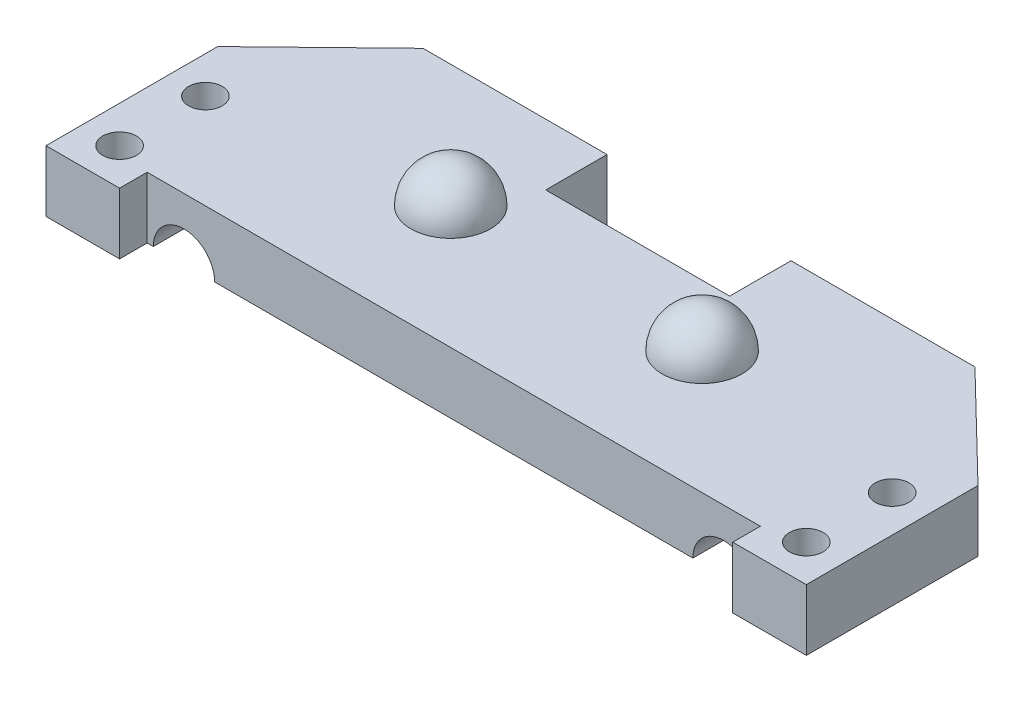
ISO-10303-21;
HEADER;
FILE_DESCRIPTION(('STEP AP214'),'2;1');
FILE_NAME('part.step','',(''),(''),'','','');
FILE_SCHEMA(('AUTOMOTIVE_DESIGN { 1 0 10303 214 1 1 1 1 }'));
ENDSEC;
DATA;
#1=APPLICATION_CONTEXT('core data for automotive mechanical design processes');
#2=APPLICATION_PROTOCOL_DEFINITION('international standard','automotive_design',2000,#1);
#3=PRODUCT_CONTEXT('',#1,'mechanical');
#4=PRODUCT('Part','Part','',(#3));
#5=PRODUCT_RELATED_PRODUCT_CATEGORY('part','',(#4));
#6=PRODUCT_DEFINITION_FORMATION('','',#4);
#7=PRODUCT_DEFINITION_CONTEXT('part definition',#1,'design');
#8=PRODUCT_DEFINITION('design','',#6,#7);
#9=PRODUCT_DEFINITION_SHAPE('','',#8);
#10=(LENGTH_UNIT() NAMED_UNIT(*) SI_UNIT(.MILLI.,.METRE.));
#11=(NAMED_UNIT(*) PLANE_ANGLE_UNIT() SI_UNIT($,.RADIAN.));
#12=(NAMED_UNIT(*) SI_UNIT($,.STERADIAN.) SOLID_ANGLE_UNIT());
#13=UNCERTAINTY_MEASURE_WITH_UNIT(LENGTH_MEASURE(1.E-05),#10,'distance_accuracy_value','');
#14=(GEOMETRIC_REPRESENTATION_CONTEXT(3) GLOBAL_UNCERTAINTY_ASSIGNED_CONTEXT((#13)) GLOBAL_UNIT_ASSIGNED_CONTEXT((#10,
#11,#12)) REPRESENTATION_CONTEXT('',''));
#15=CARTESIAN_POINT('',(0.,0.,0.));
#16=DIRECTION('',(0.,0.,1.));
#17=DIRECTION('',(1.,0.,0.));
#18=AXIS2_PLACEMENT_3D('',#15,#16,#17);
#19=CARTESIAN_POINT('',(0.,0.,0.));
#20=DIRECTION('',(0.,-1.,0.));
#21=DIRECTION('',(0.,0.,-1.));
#22=AXIS2_PLACEMENT_3D('',#19,#20,#21);
#23=PLANE('',#22);
#24=DIRECTION('',(0.,0.,1.));
#25=VECTOR('',#24,1.);
#26=CARTESIAN_POINT('',(47.,0.,-20.));
#27=LINE('',#26,#25);
#28=CARTESIAN_POINT('',(47.,0.,-18.0588235294118));
#29=VERTEX_POINT('',#28);
#30=CARTESIAN_POINT('',(47.,0.,0.));
#31=VERTEX_POINT('',#30);
#32=EDGE_CURVE('E182',#29,#31,#27,.T.);
#33=ORIENTED_EDGE('',*,*,#32,.F.);
#34=DIRECTION('',(0.717580691628317,0.,0.69647537716866));
#35=VECTOR('',#34,1.);
#36=CARTESIAN_POINT('',(45.,0.,-20.));
#37=LINE('',#36,#35);
#38=CARTESIAN_POINT('',(53.5,0.,-11.75));
#39=VERTEX_POINT('',#38);
#40=EDGE_CURVE('E246',#29,#39,#37,.T.);
#41=ORIENTED_EDGE('',*,*,#40,.T.);
#42=DIRECTION('',(0.,0.,1.));
#43=VECTOR('',#42,1.);
#44=CARTESIAN_POINT('',(53.5,0.,-11.75));
#45=LINE('',#44,#43);
#46=CARTESIAN_POINT('',(53.5,0.,2.25));
#47=VERTEX_POINT('',#46);
#48=EDGE_CURVE('E268',#39,#47,#45,.T.);
#49=ORIENTED_EDGE('',*,*,#48,.T.);
#50=DIRECTION('',(-1.,0.,0.));
#51=VECTOR('',#50,1.);
#52=CARTESIAN_POINT('',(53.5,0.,2.25));
#53=LINE('',#52,#51);
#54=CARTESIAN_POINT('',(47.5,0.,2.25));
#55=VERTEX_POINT('',#54);
#56=EDGE_CURVE('E264',#47,#55,#53,.T.);
#57=ORIENTED_EDGE('',*,*,#56,.T.);
#58=DIRECTION('',(0.,0.,-1.));
#59=VECTOR('',#58,1.);
#60=CARTESIAN_POINT('',(47.5,0.,2.25));
#61=LINE('',#60,#59);
#62=CARTESIAN_POINT('',(47.5,0.,0.));
#63=VERTEX_POINT('',#62);
#64=EDGE_CURVE('E260',#55,#63,#61,.T.);
#65=ORIENTED_EDGE('',*,*,#64,.T.);
#66=DIRECTION('',(1.,0.,0.));
#67=VECTOR('',#66,1.);
#68=CARTESIAN_POINT('',(0.,0.,0.));
#69=LINE('',#68,#67);
#70=EDGE_CURVE('E199',#31,#63,#69,.T.);
#71=ORIENTED_EDGE('',*,*,#70,.F.);
#72=EDGE_LOOP('',(#33,#41,#49,#57,#65,#71));
#73=FACE_BOUND('',#72,.T.);
#74=CARTESIAN_POINT('',(50.5,0.,-0.749999999999996));
#75=DIRECTION('',(0.,-1.,0.));
#76=DIRECTION('',(0.,0.,-1.));
#77=AXIS2_PLACEMENT_3D('',#74,#75,#76);
#78=CIRCLE('',#77,1.375);
#79=CARTESIAN_POINT('',(50.5,0.,-2.125));
#80=VERTEX_POINT('',#79);
#81=EDGE_CURVE('E272',#80,#80,#78,.T.);
#82=ORIENTED_EDGE('',*,*,#81,.F.);
#83=EDGE_LOOP('',(#82));
#84=FACE_BOUND('',#83,.T.);
#85=CARTESIAN_POINT('',(50.5,0.,-7.75));
#86=DIRECTION('',(0.,-1.,0.));
#87=DIRECTION('',(0.,0.,-1.));
#88=AXIS2_PLACEMENT_3D('',#85,#86,#87);
#89=CIRCLE('',#88,1.375);
#90=CARTESIAN_POINT('',(50.5,0.,-9.125));
#91=VERTEX_POINT('',#90);
#92=EDGE_CURVE('E276',#91,#91,#89,.T.);
#93=ORIENTED_EDGE('',*,*,#92,.F.);
#94=EDGE_LOOP('',(#93));
#95=FACE_BOUND('',#94,.T.);
#96=ADVANCED_FACE('F38',(#73,#84,#95),#23,.T.);
#97=DIRECTION('',(0.,0.,1.));
#98=VECTOR('',#97,1.);
#99=CARTESIAN_POINT('',(42.,0.,-20.));
#100=LINE('',#99,#98);
#101=CARTESIAN_POINT('',(42.,0.,0.));
#102=VERTEX_POINT('',#101);
#103=CARTESIAN_POINT('',(42.,0.,-20.));
#104=VERTEX_POINT('',#103);
#105=EDGE_CURVE('E386',#102,#104,#100,.F.);
#106=ORIENTED_EDGE('',*,*,#105,.F.);
#107=CARTESIAN_POINT('',(3.,0.,0.));
#108=VERTEX_POINT('',#107);
#109=EDGE_CURVE('E180',#108,#102,#69,.T.);
#110=ORIENTED_EDGE('',*,*,#109,.F.);
#111=DIRECTION('',(0.,0.,1.));
#112=VECTOR('',#111,1.);
#113=CARTESIAN_POINT('',(3.,0.,-20.));
#114=LINE('',#113,#112);
#115=CARTESIAN_POINT('',(3.,0.,-20.));
#116=VERTEX_POINT('',#115);
#117=EDGE_CURVE('E164',#116,#108,#114,.T.);
#118=ORIENTED_EDGE('',*,*,#117,.F.);
#119=DIRECTION('',(-1.,0.,0.));
#120=VECTOR('',#119,1.);
#121=CARTESIAN_POINT('',(0.,0.,-20.));
#122=LINE('',#121,#120);
#123=CARTESIAN_POINT('',(15.,0.,-20.));
#124=VERTEX_POINT('',#123);
#125=EDGE_CURVE('E178',#124,#116,#122,.T.);
#126=ORIENTED_EDGE('',*,*,#125,.F.);
#127=DIRECTION('',(0.,0.,-1.));
#128=VECTOR('',#127,1.);
#129=CARTESIAN_POINT('',(15.,0.,-20.));
#130=LINE('',#129,#128);
#131=CARTESIAN_POINT('',(15.,0.,-15.));
#132=VERTEX_POINT('',#131);
#133=EDGE_CURVE('E369',#132,#124,#130,.T.);
#134=ORIENTED_EDGE('',*,*,#133,.F.);
#135=DIRECTION('',(-1.,0.,0.));
#136=VECTOR('',#135,1.);
#137=CARTESIAN_POINT('',(30.,0.,-15.));
#138=LINE('',#137,#136);
#139=CARTESIAN_POINT('',(30.,0.,-15.));
#140=VERTEX_POINT('',#139);
#141=EDGE_CURVE('E379',#140,#132,#138,.T.);
#142=ORIENTED_EDGE('',*,*,#141,.F.);
#143=DIRECTION('',(0.,0.,1.));
#144=VECTOR('',#143,1.);
#145=CARTESIAN_POINT('',(30.,0.,-20.));
#146=LINE('',#145,#144);
#147=CARTESIAN_POINT('',(30.,0.,-20.));
#148=VERTEX_POINT('',#147);
#149=EDGE_CURVE('E383',#148,#140,#146,.T.);
#150=ORIENTED_EDGE('',*,*,#149,.F.);
#151=EDGE_CURVE('E190',#104,#148,#122,.T.);
#152=ORIENTED_EDGE('',*,*,#151,.F.);
#153=EDGE_LOOP('',(#106,#110,#118,#126,#134,#142,#150,#152));
#154=FACE_BOUND('',#153,.T.);
#155=ADVANCED_FACE('F176',(#154),#23,.T.);
#156=CARTESIAN_POINT('',(0.,5.,-20.));
#157=DIRECTION('',(0.,0.,1.));
#158=DIRECTION('',(1.,0.,0.));
#159=AXIS2_PLACEMENT_3D('',#156,#157,#158);
#160=PLANE('',#159);
#161=DIRECTION('',(0.,-1.,0.));
#162=VECTOR('',#161,1.);
#163=CARTESIAN_POINT('',(45.,5.,-20.));
#164=LINE('',#163,#162);
#165=CARTESIAN_POINT('',(45.,5.,-20.));
#166=VERTEX_POINT('',#165);
#167=CARTESIAN_POINT('',(45.,2.44948974278318,-20.));
#168=VERTEX_POINT('',#167);
#169=EDGE_CURVE('E205',#166,#168,#164,.T.);
#170=ORIENTED_EDGE('',*,*,#169,.T.);
#171=CARTESIAN_POINT('',(44.5,0.,-20.));
#172=DIRECTION('',(0.,0.,1.));
#173=DIRECTION('',(1.,0.,0.));
#174=AXIS2_PLACEMENT_3D('',#171,#172,#173);
#175=CIRCLE('',#174,2.5);
#176=EDGE_CURVE('E53',#168,#104,#175,.T.);
#177=ORIENTED_EDGE('',*,*,#176,.T.);
#178=ORIENTED_EDGE('',*,*,#151,.T.);
#179=DIRECTION('',(0.,-1.,0.));
#180=VECTOR('',#179,1.);
#181=CARTESIAN_POINT('',(30.,13.625,-20.));
#182=LINE('',#181,#180);
#183=CARTESIAN_POINT('',(30.,5.,-20.));
#184=VERTEX_POINT('',#183);
#185=EDGE_CURVE('E363',#184,#148,#182,.T.);
#186=ORIENTED_EDGE('',*,*,#185,.F.);
#187=DIRECTION('',(-1.,0.,0.));
#188=VECTOR('',#187,1.);
#189=CARTESIAN_POINT('',(0.,5.,-20.));
#190=LINE('',#189,#188);
#191=EDGE_CURVE('E206',#166,#184,#190,.T.);
#192=ORIENTED_EDGE('',*,*,#191,.F.);
#193=EDGE_LOOP('',(#170,#177,#178,#186,#192));
#194=FACE_BOUND('',#193,.T.);
#195=ADVANCED_FACE('F403',(#194),#160,.F.);
#196=CARTESIAN_POINT('',(0.,5.,0.));
#197=DIRECTION('',(0.,0.,-1.));
#198=DIRECTION('',(-1.,0.,0.));
#199=AXIS2_PLACEMENT_3D('',#196,#197,#198);
#200=PLANE('',#199);
#201=ORIENTED_EDGE('',*,*,#109,.T.);
#202=CARTESIAN_POINT('',(44.5,0.,0.));
#203=DIRECTION('',(0.,0.,-1.));
#204=DIRECTION('',(-1.,0.,0.));
#205=AXIS2_PLACEMENT_3D('',#202,#203,#204);
#206=CIRCLE('',#205,2.5);
#207=EDGE_CURVE('E389',#102,#31,#206,.T.);
#208=ORIENTED_EDGE('',*,*,#207,.T.);
#209=ORIENTED_EDGE('',*,*,#70,.T.);
#210=DIRECTION('',(0.,-1.,0.));
#211=VECTOR('',#210,1.);
#212=CARTESIAN_POINT('',(47.5,28.8183227789028,0.));
#213=LINE('',#212,#211);
#214=CARTESIAN_POINT('',(47.5,5.,0.));
#215=VERTEX_POINT('',#214);
#216=EDGE_CURVE('E249',#215,#63,#213,.T.);
#217=ORIENTED_EDGE('',*,*,#216,.F.);
#218=DIRECTION('',(1.,0.,0.));
#219=VECTOR('',#218,1.);
#220=CARTESIAN_POINT('',(0.,5.,0.));
#221=LINE('',#220,#219);
#222=CARTESIAN_POINT('',(-2.5,5.,0.));
#223=VERTEX_POINT('',#222);
#224=EDGE_CURVE('E196',#223,#215,#221,.T.);
#225=ORIENTED_EDGE('',*,*,#224,.F.);
#226=DIRECTION('',(0.,-1.,0.));
#227=VECTOR('',#226,1.);
#228=CARTESIAN_POINT('',(-2.5,28.8183227789028,0.));
#229=LINE('',#228,#227);
#230=CARTESIAN_POINT('',(-2.5,0.,0.));
#231=VERTEX_POINT('',#230);
#232=EDGE_CURVE('E310',#223,#231,#229,.T.);
#233=ORIENTED_EDGE('',*,*,#232,.T.);
#234=CARTESIAN_POINT('',(-2.,0.,0.));
#235=VERTEX_POINT('',#234);
#236=EDGE_CURVE('E191',#231,#235,#69,.T.);
#237=ORIENTED_EDGE('',*,*,#236,.T.);
#238=CARTESIAN_POINT('',(0.5,0.,0.));
#239=DIRECTION('',(0.,0.,-1.));
#240=DIRECTION('',(-1.,0.,0.));
#241=AXIS2_PLACEMENT_3D('',#238,#239,#240);
#242=CIRCLE('',#241,2.5);
#243=EDGE_CURVE('E183',#235,#108,#242,.T.);
#244=ORIENTED_EDGE('',*,*,#243,.T.);
#245=EDGE_LOOP('',(#201,#208,#209,#217,#225,#233,#237,#244));
#246=FACE_BOUND('',#245,.T.);
#247=ADVANCED_FACE('F40',(#246),#200,.F.);
#248=ORIENTED_EDGE('',*,*,#125,.T.);
#249=CARTESIAN_POINT('',(0.5,0.,-20.));
#250=DIRECTION('',(0.,0.,1.));
#251=DIRECTION('',(-1.,0.,0.));
#252=AXIS2_PLACEMENT_3D('',#249,#250,#251);
#253=CIRCLE('',#252,2.5);
#254=CARTESIAN_POINT('',(0.,2.44948974278318,-20.));
#255=VERTEX_POINT('',#254);
#256=EDGE_CURVE('E161',#116,#255,#253,.T.);
#257=ORIENTED_EDGE('',*,*,#256,.T.);
#258=DIRECTION('',(0.,-1.,0.));
#259=VECTOR('',#258,1.);
#260=CARTESIAN_POINT('',(0.,5.,-20.));
#261=LINE('',#260,#259);
#262=CARTESIAN_POINT('',(0.,5.,-20.));
#263=VERTEX_POINT('',#262);
#264=EDGE_CURVE('E202',#263,#255,#261,.T.);
#265=ORIENTED_EDGE('',*,*,#264,.F.);
#266=CARTESIAN_POINT('',(15.,5.,-20.));
#267=VERTEX_POINT('',#266);
#268=EDGE_CURVE('E227',#267,#263,#190,.T.);
#269=ORIENTED_EDGE('',*,*,#268,.F.);
#270=DIRECTION('',(0.,-1.,0.));
#271=VECTOR('',#270,1.);
#272=CARTESIAN_POINT('',(15.,13.625,-20.));
#273=LINE('',#272,#271);
#274=EDGE_CURVE('E188',#267,#124,#273,.T.);
#275=ORIENTED_EDGE('',*,*,#274,.T.);
#276=EDGE_LOOP('',(#248,#257,#265,#269,#275));
#277=FACE_BOUND('',#276,.T.);
#278=ADVANCED_FACE('F186',(#277),#160,.F.);
#279=CARTESIAN_POINT('',(0.,5.,0.));
#280=DIRECTION('',(0.,-1.,0.));
#281=DIRECTION('',(0.,0.,-1.));
#282=AXIS2_PLACEMENT_3D('',#279,#280,#281);
#283=PLANE('',#282);
#284=ORIENTED_EDGE('',*,*,#191,.T.);
#285=DIRECTION('',(0.,0.,1.));
#286=VECTOR('',#285,1.);
#287=CARTESIAN_POINT('',(30.,5.,0.));
#288=LINE('',#287,#286);
#289=CARTESIAN_POINT('',(30.,5.,-15.));
#290=VERTEX_POINT('',#289);
#291=EDGE_CURVE('E338',#184,#290,#288,.T.);
#292=ORIENTED_EDGE('',*,*,#291,.T.);
#293=DIRECTION('',(-1.,0.,0.));
#294=VECTOR('',#293,1.);
#295=CARTESIAN_POINT('',(0.,5.,-15.));
#296=LINE('',#295,#294);
#297=CARTESIAN_POINT('',(15.,5.,-15.));
#298=VERTEX_POINT('',#297);
#299=EDGE_CURVE('E359',#290,#298,#296,.T.);
#300=ORIENTED_EDGE('',*,*,#299,.T.);
#301=DIRECTION('',(0.,0.,-1.));
#302=VECTOR('',#301,1.);
#303=CARTESIAN_POINT('',(15.,5.,0.));
#304=LINE('',#303,#302);
#305=EDGE_CURVE('E355',#298,#267,#304,.T.);
#306=ORIENTED_EDGE('',*,*,#305,.T.);
#307=ORIENTED_EDGE('',*,*,#268,.T.);
#308=DIRECTION('',(-0.717580691628317,0.,0.69647537716866));
#309=VECTOR('',#308,1.);
#310=CARTESIAN_POINT('',(0.,5.,-20.));
#311=LINE('',#310,#309);
#312=CARTESIAN_POINT('',(-8.50000000000001,5.,-11.75));
#313=VERTEX_POINT('',#312);
#314=EDGE_CURVE('E342',#263,#313,#311,.T.);
#315=ORIENTED_EDGE('',*,*,#314,.T.);
#316=DIRECTION('',(0.,0.,1.));
#317=VECTOR('',#316,1.);
#318=CARTESIAN_POINT('',(-8.50000000000001,5.,-11.75));
#319=LINE('',#318,#317);
#320=CARTESIAN_POINT('',(-8.50000000000001,5.,2.25));
#321=VERTEX_POINT('',#320);
#322=EDGE_CURVE('E314',#313,#321,#319,.T.);
#323=ORIENTED_EDGE('',*,*,#322,.T.);
#324=DIRECTION('',(1.,0.,0.));
#325=VECTOR('',#324,1.);
#326=CARTESIAN_POINT('',(-8.50000000000001,5.,2.25));
#327=LINE('',#326,#325);
#328=CARTESIAN_POINT('',(-2.5,5.,2.25));
#329=VERTEX_POINT('',#328);
#330=EDGE_CURVE('E299',#321,#329,#327,.T.);
#331=ORIENTED_EDGE('',*,*,#330,.T.);
#332=DIRECTION('',(0.,0.,-1.));
#333=VECTOR('',#332,1.);
#334=CARTESIAN_POINT('',(-2.5,5.,2.25));
#335=LINE('',#334,#333);
#336=EDGE_CURVE('E339',#329,#223,#335,.T.);
#337=ORIENTED_EDGE('',*,*,#336,.T.);
#338=ORIENTED_EDGE('',*,*,#224,.T.);
#339=DIRECTION('',(0.,0.,1.));
#340=VECTOR('',#339,1.);
#341=CARTESIAN_POINT('',(47.5,5.,2.25));
#342=LINE('',#341,#340);
#343=CARTESIAN_POINT('',(47.5,5.,2.25));
#344=VERTEX_POINT('',#343);
#345=EDGE_CURVE('E257',#215,#344,#342,.T.);
#346=ORIENTED_EDGE('',*,*,#345,.T.);
#347=DIRECTION('',(1.,0.,0.));
#348=VECTOR('',#347,1.);
#349=CARTESIAN_POINT('',(53.5,5.,2.25));
#350=LINE('',#349,#348);
#351=CARTESIAN_POINT('',(53.5,5.,2.25));
#352=VERTEX_POINT('',#351);
#353=EDGE_CURVE('E241',#344,#352,#350,.T.);
#354=ORIENTED_EDGE('',*,*,#353,.T.);
#355=DIRECTION('',(0.,0.,-1.));
#356=VECTOR('',#355,1.);
#357=CARTESIAN_POINT('',(53.5,5.,-11.75));
#358=LINE('',#357,#356);
#359=CARTESIAN_POINT('',(53.5,5.,-11.75));
#360=VERTEX_POINT('',#359);
#361=EDGE_CURVE('E281',#352,#360,#358,.T.);
#362=ORIENTED_EDGE('',*,*,#361,.T.);
#363=DIRECTION('',(-0.717580691628317,0.,-0.69647537716866));
#364=VECTOR('',#363,1.);
#365=CARTESIAN_POINT('',(45.,5.,-20.));
#366=LINE('',#365,#364);
#367=EDGE_CURVE('E284',#360,#166,#366,.T.);
#368=ORIENTED_EDGE('',*,*,#367,.T.);
#369=EDGE_LOOP('',(#284,#292,#300,#306,#307,#315,#323,#331,#337,#338,#346,#354,#362,#368));
#370=FACE_BOUND('',#369,.T.);
#371=CARTESIAN_POINT('',(32.75,5.,-10.));
#372=DIRECTION('',(0.,-1.,0.));
#373=DIRECTION('',(0.,0.,-1.));
#374=AXIS2_PLACEMENT_3D('',#371,#372,#373);
#375=CIRCLE('',#374,3.25);
#376=CARTESIAN_POINT('',(32.75,5.,-13.25));
#377=VERTEX_POINT('',#376);
#378=EDGE_CURVE('E214',#377,#377,#375,.T.);
#379=ORIENTED_EDGE('',*,*,#378,.T.);
#380=EDGE_LOOP('',(#379));
#381=FACE_BOUND('',#380,.T.);
#382=CARTESIAN_POINT('',(12.25,5.,-10.));
#383=DIRECTION('',(0.,-1.,0.));
#384=DIRECTION('',(0.,0.,-1.));
#385=AXIS2_PLACEMENT_3D('',#382,#383,#384);
#386=CIRCLE('',#385,3.25);
#387=CARTESIAN_POINT('',(12.25,5.,-13.25));
#388=VERTEX_POINT('',#387);
#389=EDGE_CURVE('E210',#388,#388,#386,.T.);
#390=ORIENTED_EDGE('',*,*,#389,.T.);
#391=EDGE_LOOP('',(#390));
#392=FACE_BOUND('',#391,.T.);
#393=CARTESIAN_POINT('',(50.5,5.,-7.75));
#394=DIRECTION('',(0.,-1.,0.));
#395=DIRECTION('',(0.,0.,-1.));
#396=AXIS2_PLACEMENT_3D('',#393,#394,#395);
#397=CIRCLE('',#396,1.375);
#398=CARTESIAN_POINT('',(50.5,5.,-9.125));
#399=VERTEX_POINT('',#398);
#400=EDGE_CURVE('E237',#399,#399,#397,.F.);
#401=ORIENTED_EDGE('',*,*,#400,.F.);
#402=EDGE_LOOP('',(#401));
#403=FACE_BOUND('',#402,.T.);
#404=CARTESIAN_POINT('',(50.5,5.,-0.749999999999996));
#405=DIRECTION('',(0.,-1.,0.));
#406=DIRECTION('',(0.,0.,-1.));
#407=AXIS2_PLACEMENT_3D('',#404,#405,#406);
#408=CIRCLE('',#407,1.375);
#409=CARTESIAN_POINT('',(50.5,5.,-2.125));
#410=VERTEX_POINT('',#409);
#411=EDGE_CURVE('E217',#410,#410,#408,.F.);
#412=ORIENTED_EDGE('',*,*,#411,.F.);
#413=EDGE_LOOP('',(#412));
#414=FACE_BOUND('',#413,.T.);
#415=CARTESIAN_POINT('',(-5.50000000000001,5.,-7.75));
#416=DIRECTION('',(0.,-1.,0.));
#417=DIRECTION('',(0.,0.,-1.));
#418=AXIS2_PLACEMENT_3D('',#415,#416,#417);
#419=CIRCLE('',#418,1.375);
#420=CARTESIAN_POINT('',(-5.50000000000001,5.,-9.12500000000001));
#421=VERTEX_POINT('',#420);
#422=EDGE_CURVE('E295',#421,#421,#419,.F.);
#423=ORIENTED_EDGE('',*,*,#422,.F.);
#424=EDGE_LOOP('',(#423));
#425=FACE_BOUND('',#424,.T.);
#426=CARTESIAN_POINT('',(-5.50000000000001,5.,-0.749999999999999));
#427=DIRECTION('',(0.,-1.,0.));
#428=DIRECTION('',(0.,0.,-1.));
#429=AXIS2_PLACEMENT_3D('',#426,#427,#428);
#430=CIRCLE('',#429,1.375);
#431=CARTESIAN_POINT('',(-5.50000000000001,5.,-2.125));
#432=VERTEX_POINT('',#431);
#433=EDGE_CURVE('E280',#432,#432,#430,.F.);
#434=ORIENTED_EDGE('',*,*,#433,.F.);
#435=EDGE_LOOP('',(#434));
#436=FACE_BOUND('',#435,.T.);
#437=ADVANCED_FACE('F414',(#370,#381,#392,#403,#414,#425,#436),#283,.F.);
#438=DIRECTION('',(0.,0.,1.));
#439=VECTOR('',#438,1.);
#440=CARTESIAN_POINT('',(-2.,0.,-20.));
#441=LINE('',#440,#439);
#442=CARTESIAN_POINT('',(-2.,0.,-18.0588235294118));
#443=VERTEX_POINT('',#442);
#444=EDGE_CURVE('E61',#235,#443,#441,.F.);
#445=ORIENTED_EDGE('',*,*,#444,.F.);
#446=ORIENTED_EDGE('',*,*,#236,.F.);
#447=DIRECTION('',(0.,0.,1.));
#448=VECTOR('',#447,1.);
#449=CARTESIAN_POINT('',(-2.5,0.,2.25));
#450=LINE('',#449,#448);
#451=CARTESIAN_POINT('',(-2.5,0.,2.25));
#452=VERTEX_POINT('',#451);
#453=EDGE_CURVE('E326',#231,#452,#450,.T.);
#454=ORIENTED_EDGE('',*,*,#453,.T.);
#455=DIRECTION('',(-1.,0.,0.));
#456=VECTOR('',#455,1.);
#457=CARTESIAN_POINT('',(-8.50000000000001,0.,2.25));
#458=LINE('',#457,#456);
#459=CARTESIAN_POINT('',(-8.50000000000001,0.,2.25));
#460=VERTEX_POINT('',#459);
#461=EDGE_CURVE('E322',#452,#460,#458,.T.);
#462=ORIENTED_EDGE('',*,*,#461,.T.);
#463=DIRECTION('',(0.,0.,-1.));
#464=VECTOR('',#463,1.);
#465=CARTESIAN_POINT('',(-8.50000000000001,0.,-11.75));
#466=LINE('',#465,#464);
#467=CARTESIAN_POINT('',(-8.50000000000001,0.,-11.75));
#468=VERTEX_POINT('',#467);
#469=EDGE_CURVE('E318',#460,#468,#466,.T.);
#470=ORIENTED_EDGE('',*,*,#469,.T.);
#471=DIRECTION('',(0.717580691628317,0.,-0.69647537716866));
#472=VECTOR('',#471,1.);
#473=CARTESIAN_POINT('',(0.,0.,-20.));
#474=LINE('',#473,#472);
#475=EDGE_CURVE('E304',#468,#443,#474,.T.);
#476=ORIENTED_EDGE('',*,*,#475,.T.);
#477=EDGE_LOOP('',(#445,#446,#454,#462,#470,#476));
#478=FACE_BOUND('',#477,.T.);
#479=CARTESIAN_POINT('',(-5.50000000000001,0.,-7.75));
#480=DIRECTION('',(0.,-1.,0.));
#481=DIRECTION('',(0.,0.,1.));
#482=AXIS2_PLACEMENT_3D('',#479,#480,#481);
#483=CIRCLE('',#482,1.375);
#484=CARTESIAN_POINT('',(-5.50000000000001,0.,-6.375));
#485=VERTEX_POINT('',#484);
#486=EDGE_CURVE('E334',#485,#485,#483,.T.);
#487=ORIENTED_EDGE('',*,*,#486,.F.);
#488=EDGE_LOOP('',(#487));
#489=FACE_BOUND('',#488,.T.);
#490=CARTESIAN_POINT('',(-5.50000000000001,0.,-0.749999999999999));
#491=DIRECTION('',(0.,-1.,0.));
#492=DIRECTION('',(0.,0.,1.));
#493=AXIS2_PLACEMENT_3D('',#490,#491,#492);
#494=CIRCLE('',#493,1.375);
#495=CARTESIAN_POINT('',(-5.50000000000001,0.,0.625000000000005));
#496=VERTEX_POINT('',#495);
#497=EDGE_CURVE('E330',#496,#496,#494,.T.);
#498=ORIENTED_EDGE('',*,*,#497,.F.);
#499=EDGE_LOOP('',(#498));
#500=FACE_BOUND('',#499,.T.);
#501=ADVANCED_FACE('F435',(#478,#489,#500),#23,.T.);
#502=CARTESIAN_POINT('',(12.25,5.,-10.));
#503=DIRECTION('',(0.,0.,-1.));
#504=DIRECTION('',(1.,0.,0.));
#505=AXIS2_PLACEMENT_3D('',#502,#503,#504);
#506=SPHERICAL_SURFACE('',#505,3.25);
#507=CARTESIAN_POINT('',(12.25,5.,-10.));
#508=DIRECTION('',(0.,-1.,0.));
#509=DIRECTION('',(0.,0.,-1.));
#510=AXIS2_PLACEMENT_3D('',#507,#508,#509);
#511=SPHERICAL_SURFACE('',#510,3.25);
#512=ORIENTED_EDGE('',*,*,#389,.F.);
#513=EDGE_LOOP('',(#512));
#514=FACE_BOUND('',#513,.T.);
#515=ADVANCED_FACE('F476',(#514),#511,.T.);
#516=CARTESIAN_POINT('',(32.75,5.,-10.));
#517=DIRECTION('',(0.,0.,-1.));
#518=DIRECTION('',(-1.,0.,0.));
#519=AXIS2_PLACEMENT_3D('',#516,#517,#518);
#520=SPHERICAL_SURFACE('',#519,3.25);
#521=CARTESIAN_POINT('',(32.75,5.,-10.));
#522=DIRECTION('',(0.,-1.,0.));
#523=DIRECTION('',(0.,0.,-1.));
#524=AXIS2_PLACEMENT_3D('',#521,#522,#523);
#525=SPHERICAL_SURFACE('',#524,3.25);
#526=ORIENTED_EDGE('',*,*,#378,.F.);
#527=EDGE_LOOP('',(#526));
#528=FACE_BOUND('',#527,.T.);
#529=ADVANCED_FACE('F469',(#528),#525,.T.);
#530=CARTESIAN_POINT('',(53.5,28.8183227789028,2.25));
#531=DIRECTION('',(0.,0.,1.));
#532=DIRECTION('',(1.,0.,0.));
#533=AXIS2_PLACEMENT_3D('',#530,#531,#532);
#534=PLANE('',#533);
#535=ORIENTED_EDGE('',*,*,#353,.F.);
#536=DIRECTION('',(0.,-1.,0.));
#537=VECTOR('',#536,1.);
#538=CARTESIAN_POINT('',(47.5,28.8183227789028,2.25));
#539=LINE('',#538,#537);
#540=EDGE_CURVE('E245',#344,#55,#539,.T.);
#541=ORIENTED_EDGE('',*,*,#540,.T.);
#542=ORIENTED_EDGE('',*,*,#56,.F.);
#543=DIRECTION('',(0.,-1.,0.));
#544=VECTOR('',#543,1.);
#545=CARTESIAN_POINT('',(53.5,28.8183227789028,2.25));
#546=LINE('',#545,#544);
#547=EDGE_CURVE('E242',#352,#47,#546,.T.);
#548=ORIENTED_EDGE('',*,*,#547,.F.);
#549=EDGE_LOOP('',(#535,#541,#542,#548));
#550=FACE_BOUND('',#549,.T.);
#551=ADVANCED_FACE('F467',(#550),#534,.T.);
#552=CARTESIAN_POINT('',(47.5,28.8183227789028,2.25));
#553=DIRECTION('',(-1.,0.,0.));
#554=DIRECTION('',(0.,0.,1.));
#555=AXIS2_PLACEMENT_3D('',#552,#553,#554);
#556=PLANE('',#555);
#557=ORIENTED_EDGE('',*,*,#345,.F.);
#558=ORIENTED_EDGE('',*,*,#216,.T.);
#559=ORIENTED_EDGE('',*,*,#64,.F.);
#560=ORIENTED_EDGE('',*,*,#540,.F.);
#561=EDGE_LOOP('',(#557,#558,#559,#560));
#562=FACE_BOUND('',#561,.T.);
#563=ADVANCED_FACE('F458',(#562),#556,.T.);
#564=CARTESIAN_POINT('',(45.,28.8183227789028,-20.));
#565=DIRECTION('',(0.69647537716866,0.,-0.717580691628317));
#566=DIRECTION('',(-0.717580691628317,0.,-0.69647537716866));
#567=AXIS2_PLACEMENT_3D('',#564,#565,#566);
#568=PLANE('',#567);
#569=CARTESIAN_POINT('',(44.5,0.,-20.4852941176471));
#570=DIRECTION('',(0.69647537716866,0.,-0.717580691628317));
#571=DIRECTION('',(0.717580691628317,0.,0.69647537716866));
#572=AXIS2_PLACEMENT_3D('',#569,#570,#571);
#573=ELLIPSE('',#572,3.48392874720063,2.5);
#574=EDGE_CURVE('E11',#168,#29,#573,.T.);
#575=ORIENTED_EDGE('',*,*,#574,.F.);
#576=ORIENTED_EDGE('',*,*,#169,.F.);
#577=ORIENTED_EDGE('',*,*,#367,.F.);
#578=DIRECTION('',(0.,-1.,0.));
#579=VECTOR('',#578,1.);
#580=CARTESIAN_POINT('',(53.5,28.8183227789028,-11.75));
#581=LINE('',#580,#579);
#582=EDGE_CURVE('E253',#360,#39,#581,.T.);
#583=ORIENTED_EDGE('',*,*,#582,.T.);
#584=ORIENTED_EDGE('',*,*,#40,.F.);
#585=EDGE_LOOP('',(#575,#576,#577,#583,#584));
#586=FACE_BOUND('',#585,.T.);
#587=ADVANCED_FACE('F420',(#586),#568,.T.);
#588=CARTESIAN_POINT('',(53.5,28.8183227789028,-11.75));
#589=DIRECTION('',(1.,0.,0.));
#590=DIRECTION('',(0.,0.,-1.));
#591=AXIS2_PLACEMENT_3D('',#588,#589,#590);
#592=PLANE('',#591);
#593=ORIENTED_EDGE('',*,*,#361,.F.);
#594=ORIENTED_EDGE('',*,*,#547,.T.);
#595=ORIENTED_EDGE('',*,*,#48,.F.);
#596=ORIENTED_EDGE('',*,*,#582,.F.);
#597=EDGE_LOOP('',(#593,#594,#595,#596));
#598=FACE_BOUND('',#597,.T.);
#599=ADVANCED_FACE('F464',(#598),#592,.T.);
#600=CARTESIAN_POINT('',(50.5,28.8183227789028,-0.749999999999996));
#601=DIRECTION('',(0.,-1.,0.));
#602=DIRECTION('',(0.,0.,-1.));
#603=AXIS2_PLACEMENT_3D('',#600,#601,#602);
#604=CYLINDRICAL_SURFACE('',#603,1.375);
#605=ORIENTED_EDGE('',*,*,#411,.T.);
#606=EDGE_LOOP('',(#605));
#607=FACE_BOUND('',#606,.T.);
#608=ORIENTED_EDGE('',*,*,#81,.T.);
#609=EDGE_LOOP('',(#608));
#610=FACE_BOUND('',#609,.T.);
#611=ADVANCED_FACE('F497',(#607,#610),#604,.F.);
#612=CARTESIAN_POINT('',(50.5,28.8183227789028,-7.75));
#613=DIRECTION('',(0.,-1.,0.));
#614=DIRECTION('',(0.,0.,-1.));
#615=AXIS2_PLACEMENT_3D('',#612,#613,#614);
#616=CYLINDRICAL_SURFACE('',#615,1.375);
#617=ORIENTED_EDGE('',*,*,#400,.T.);
#618=EDGE_LOOP('',(#617));
#619=FACE_BOUND('',#618,.T.);
#620=ORIENTED_EDGE('',*,*,#92,.T.);
#621=EDGE_LOOP('',(#620));
#622=FACE_BOUND('',#621,.T.);
#623=ADVANCED_FACE('F502',(#619,#622),#616,.F.);
#624=CARTESIAN_POINT('',(-8.50000000000001,28.8183227789028,2.25));
#625=DIRECTION('',(0.,0.,1.));
#626=DIRECTION('',(1.,0.,0.));
#627=AXIS2_PLACEMENT_3D('',#624,#625,#626);
#628=PLANE('',#627);
#629=ORIENTED_EDGE('',*,*,#330,.F.);
#630=DIRECTION('',(0.,-1.,0.));
#631=VECTOR('',#630,1.);
#632=CARTESIAN_POINT('',(-8.50000000000001,28.8183227789028,2.25));
#633=LINE('',#632,#631);
#634=EDGE_CURVE('E303',#321,#460,#633,.T.);
#635=ORIENTED_EDGE('',*,*,#634,.T.);
#636=ORIENTED_EDGE('',*,*,#461,.F.);
#637=DIRECTION('',(0.,-1.,0.));
#638=VECTOR('',#637,1.);
#639=CARTESIAN_POINT('',(-2.5,28.8183227789028,2.25));
#640=LINE('',#639,#638);
#641=EDGE_CURVE('E300',#329,#452,#640,.T.);
#642=ORIENTED_EDGE('',*,*,#641,.F.);
#643=EDGE_LOOP('',(#629,#635,#636,#642));
#644=FACE_BOUND('',#643,.T.);
#645=ADVANCED_FACE('F451',(#644),#628,.T.);
#646=CARTESIAN_POINT('',(-8.50000000000001,28.8183227789028,-11.75));
#647=DIRECTION('',(-1.,0.,0.));
#648=DIRECTION('',(0.,0.,1.));
#649=AXIS2_PLACEMENT_3D('',#646,#647,#648);
#650=PLANE('',#649);
#651=ORIENTED_EDGE('',*,*,#322,.F.);
#652=DIRECTION('',(0.,-1.,0.));
#653=VECTOR('',#652,1.);
#654=CARTESIAN_POINT('',(-8.50000000000001,28.8183227789028,-11.75));
#655=LINE('',#654,#653);
#656=EDGE_CURVE('E307',#313,#468,#655,.T.);
#657=ORIENTED_EDGE('',*,*,#656,.T.);
#658=ORIENTED_EDGE('',*,*,#469,.F.);
#659=ORIENTED_EDGE('',*,*,#634,.F.);
#660=EDGE_LOOP('',(#651,#657,#658,#659));
#661=FACE_BOUND('',#660,.T.);
#662=ADVANCED_FACE('F446',(#661),#650,.T.);
#663=CARTESIAN_POINT('',(0.,28.8183227789028,-20.));
#664=DIRECTION('',(-0.69647537716866,0.,-0.717580691628317));
#665=DIRECTION('',(-0.717580691628317,0.,0.69647537716866));
#666=AXIS2_PLACEMENT_3D('',#663,#664,#665);
#667=PLANE('',#666);
#668=CARTESIAN_POINT('',(0.5,0.,-20.4852941176471));
#669=DIRECTION('',(-0.69647537716866,0.,-0.717580691628317));
#670=DIRECTION('',(-0.717580691628317,0.,0.69647537716866));
#671=AXIS2_PLACEMENT_3D('',#668,#669,#670);
#672=ELLIPSE('',#671,3.48392874720063,2.5);
#673=EDGE_CURVE('E47',#443,#255,#672,.T.);
#674=ORIENTED_EDGE('',*,*,#673,.F.);
#675=ORIENTED_EDGE('',*,*,#475,.F.);
#676=ORIENTED_EDGE('',*,*,#656,.F.);
#677=ORIENTED_EDGE('',*,*,#314,.F.);
#678=ORIENTED_EDGE('',*,*,#264,.T.);
#679=EDGE_LOOP('',(#674,#675,#676,#677,#678));
#680=FACE_BOUND('',#679,.T.);
#681=ADVANCED_FACE('F441',(#680),#667,.T.);
#682=CARTESIAN_POINT('',(-2.5,28.8183227789028,2.25));
#683=DIRECTION('',(1.,0.,0.));
#684=DIRECTION('',(0.,0.,-1.));
#685=AXIS2_PLACEMENT_3D('',#682,#683,#684);
#686=PLANE('',#685);
#687=ORIENTED_EDGE('',*,*,#336,.F.);
#688=ORIENTED_EDGE('',*,*,#641,.T.);
#689=ORIENTED_EDGE('',*,*,#453,.F.);
#690=ORIENTED_EDGE('',*,*,#232,.F.);
#691=EDGE_LOOP('',(#687,#688,#689,#690));
#692=FACE_BOUND('',#691,.T.);
#693=ADVANCED_FACE('F455',(#692),#686,.T.);
#694=CARTESIAN_POINT('',(-5.50000000000001,28.8183227789028,-0.749999999999999));
#695=DIRECTION('',(0.,-1.,0.));
#696=DIRECTION('',(0.,0.,-1.));
#697=AXIS2_PLACEMENT_3D('',#694,#695,#696);
#698=CYLINDRICAL_SURFACE('',#697,1.375);
#699=ORIENTED_EDGE('',*,*,#433,.T.);
#700=EDGE_LOOP('',(#699));
#701=FACE_BOUND('',#700,.T.);
#702=ORIENTED_EDGE('',*,*,#497,.T.);
#703=EDGE_LOOP('',(#702));
#704=FACE_BOUND('',#703,.T.);
#705=ADVANCED_FACE('F514',(#701,#704),#698,.F.);
#706=CARTESIAN_POINT('',(-5.50000000000001,28.8183227789028,-7.75));
#707=DIRECTION('',(0.,-1.,0.));
#708=DIRECTION('',(0.,0.,-1.));
#709=AXIS2_PLACEMENT_3D('',#706,#707,#708);
#710=CYLINDRICAL_SURFACE('',#709,1.375);
#711=ORIENTED_EDGE('',*,*,#422,.T.);
#712=EDGE_LOOP('',(#711));
#713=FACE_BOUND('',#712,.T.);
#714=ORIENTED_EDGE('',*,*,#486,.T.);
#715=EDGE_LOOP('',(#714));
#716=FACE_BOUND('',#715,.T.);
#717=ADVANCED_FACE('F523',(#713,#716),#710,.F.);
#718=CARTESIAN_POINT('',(30.,13.625,-20.));
#719=DIRECTION('',(1.,0.,0.));
#720=DIRECTION('',(0.,0.,-1.));
#721=AXIS2_PLACEMENT_3D('',#718,#719,#720);
#722=PLANE('',#721);
#723=ORIENTED_EDGE('',*,*,#185,.T.);
#724=ORIENTED_EDGE('',*,*,#149,.T.);
#725=DIRECTION('',(0.,-1.,0.));
#726=VECTOR('',#725,1.);
#727=CARTESIAN_POINT('',(30.,13.625,-15.));
#728=LINE('',#727,#726);
#729=EDGE_CURVE('E364',#290,#140,#728,.T.);
#730=ORIENTED_EDGE('',*,*,#729,.F.);
#731=ORIENTED_EDGE('',*,*,#291,.F.);
#732=EDGE_LOOP('',(#723,#724,#730,#731));
#733=FACE_BOUND('',#732,.T.);
#734=ADVANCED_FACE('F410',(#733),#722,.F.);
#735=CARTESIAN_POINT('',(15.,13.625,-20.));
#736=DIRECTION('',(-1.,0.,0.));
#737=DIRECTION('',(0.,0.,1.));
#738=AXIS2_PLACEMENT_3D('',#735,#736,#737);
#739=PLANE('',#738);
#740=DIRECTION('',(0.,-1.,0.));
#741=VECTOR('',#740,1.);
#742=CARTESIAN_POINT('',(15.,13.625,-15.));
#743=LINE('',#742,#741);
#744=EDGE_CURVE('E368',#298,#132,#743,.T.);
#745=ORIENTED_EDGE('',*,*,#744,.T.);
#746=ORIENTED_EDGE('',*,*,#133,.T.);
#747=ORIENTED_EDGE('',*,*,#274,.F.);
#748=ORIENTED_EDGE('',*,*,#305,.F.);
#749=EDGE_LOOP('',(#745,#746,#747,#748));
#750=FACE_BOUND('',#749,.T.);
#751=ADVANCED_FACE('F530',(#750),#739,.F.);
#752=CARTESIAN_POINT('',(30.,13.625,-15.));
#753=DIRECTION('',(0.,0.,1.));
#754=DIRECTION('',(1.,0.,0.));
#755=AXIS2_PLACEMENT_3D('',#752,#753,#754);
#756=PLANE('',#755);
#757=ORIENTED_EDGE('',*,*,#729,.T.);
#758=ORIENTED_EDGE('',*,*,#141,.T.);
#759=ORIENTED_EDGE('',*,*,#744,.F.);
#760=ORIENTED_EDGE('',*,*,#299,.F.);
#761=EDGE_LOOP('',(#757,#758,#759,#760));
#762=FACE_BOUND('',#761,.T.);
#763=ADVANCED_FACE('F412',(#762),#756,.F.);
#764=CARTESIAN_POINT('',(0.5,0.,-20.));
#765=DIRECTION('',(0.,0.,1.));
#766=DIRECTION('',(1.,0.,0.));
#767=AXIS2_PLACEMENT_3D('',#764,#765,#766);
#768=CYLINDRICAL_SURFACE('',#767,2.5);
#769=ORIENTED_EDGE('',*,*,#117,.T.);
#770=ORIENTED_EDGE('',*,*,#243,.F.);
#771=ORIENTED_EDGE('',*,*,#444,.T.);
#772=ORIENTED_EDGE('',*,*,#673,.T.);
#773=ORIENTED_EDGE('',*,*,#256,.F.);
#774=EDGE_LOOP('',(#769,#770,#771,#772,#773));
#775=FACE_BOUND('',#774,.T.);
#776=ADVANCED_FACE('F163',(#775),#768,.F.);
#777=CARTESIAN_POINT('',(44.5,0.,-20.));
#778=DIRECTION('',(0.,0.,1.));
#779=DIRECTION('',(1.,0.,0.));
#780=AXIS2_PLACEMENT_3D('',#777,#778,#779);
#781=CYLINDRICAL_SURFACE('',#780,2.5);
#782=ORIENTED_EDGE('',*,*,#105,.T.);
#783=ORIENTED_EDGE('',*,*,#176,.F.);
#784=ORIENTED_EDGE('',*,*,#574,.T.);
#785=ORIENTED_EDGE('',*,*,#32,.T.);
#786=ORIENTED_EDGE('',*,*,#207,.F.);
#787=EDGE_LOOP('',(#782,#783,#784,#785,#786));
#788=FACE_BOUND('',#787,.T.);
#789=ADVANCED_FACE('F423',(#788),#781,.F.);
#790=CLOSED_SHELL('',(#96,#155,#195,#247,#278,#437,#501,#515,#529,#551,#563,#587,#599,#611,#623,
#645,#662,#681,#693,#705,#717,#734,#751,#763,#776,#789));
#791=MANIFOLD_SOLID_BREP('B2',#790);
#792=ADVANCED_BREP_SHAPE_REPRESENTATION('',(#18,#791),#14);
#793=SHAPE_DEFINITION_REPRESENTATION(#9,#792);
ENDSEC;
END-ISO-10303-21;
